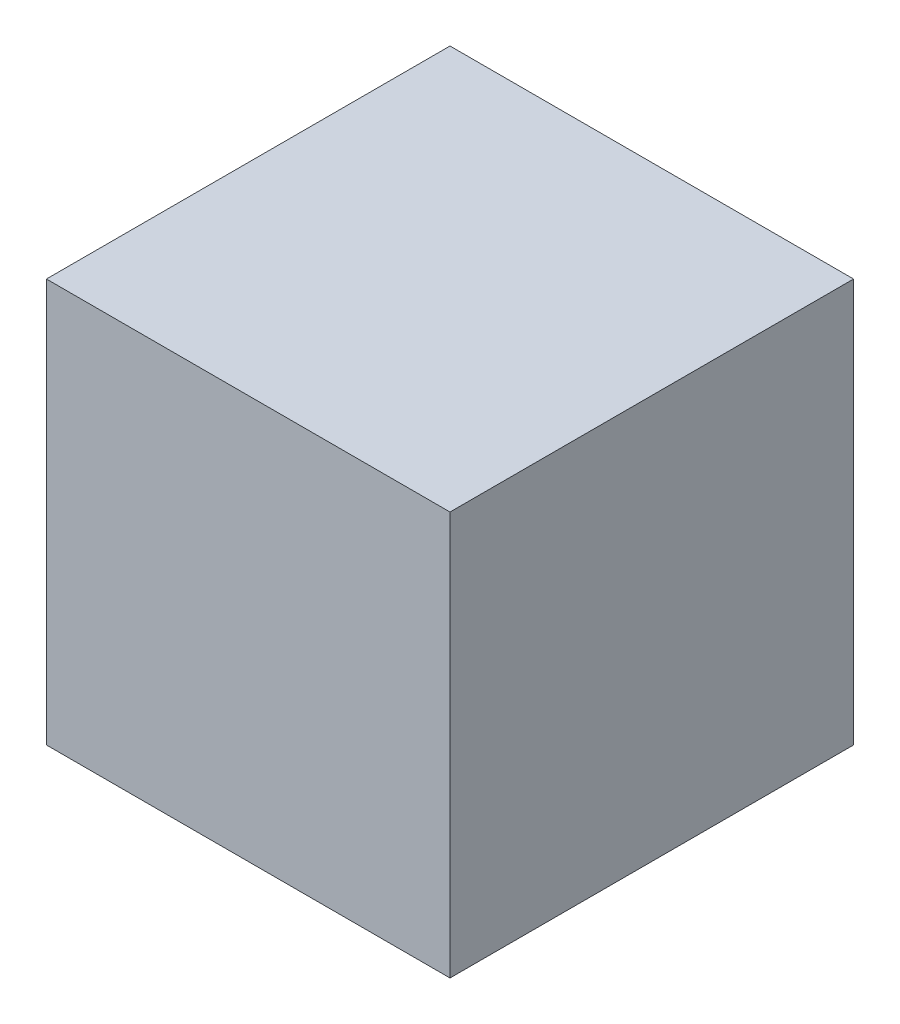
ISO-10303-21;
HEADER;
FILE_DESCRIPTION(('STEP AP214'),'2;1');
FILE_NAME('part.step','',(''),(''),'','','');
FILE_SCHEMA(('AUTOMOTIVE_DESIGN { 1 0 10303 214 1 1 1 1 }'));
ENDSEC;
DATA;
#1=APPLICATION_CONTEXT('core data for automotive mechanical design processes');
#2=APPLICATION_PROTOCOL_DEFINITION('international standard','automotive_design',2000,#1);
#3=PRODUCT_CONTEXT('',#1,'mechanical');
#4=PRODUCT('Part','Part','',(#3));
#5=PRODUCT_RELATED_PRODUCT_CATEGORY('part','',(#4));
#6=PRODUCT_DEFINITION_FORMATION('','',#4);
#7=PRODUCT_DEFINITION_CONTEXT('part definition',#1,'design');
#8=PRODUCT_DEFINITION('design','',#6,#7);
#9=PRODUCT_DEFINITION_SHAPE('','',#8);
#10=(LENGTH_UNIT() NAMED_UNIT(*) SI_UNIT(.MILLI.,.METRE.));
#11=(NAMED_UNIT(*) PLANE_ANGLE_UNIT() SI_UNIT($,.RADIAN.));
#12=(NAMED_UNIT(*) SI_UNIT($,.STERADIAN.) SOLID_ANGLE_UNIT());
#13=UNCERTAINTY_MEASURE_WITH_UNIT(LENGTH_MEASURE(1.E-05),#10,'distance_accuracy_value','');
#14=(GEOMETRIC_REPRESENTATION_CONTEXT(3) GLOBAL_UNCERTAINTY_ASSIGNED_CONTEXT((#13)) GLOBAL_UNIT_ASSIGNED_CONTEXT((#10,
#11,#12)) REPRESENTATION_CONTEXT('',''));
#15=CARTESIAN_POINT('',(0.,0.,0.));
#16=DIRECTION('',(0.,0.,1.));
#17=DIRECTION('',(1.,0.,0.));
#18=AXIS2_PLACEMENT_3D('',#15,#16,#17);
#19=CARTESIAN_POINT('',(24.,24.,48.));
#20=DIRECTION('',(-1.,0.,0.));
#21=DIRECTION('',(0.,-1.,0.));
#22=AXIS2_PLACEMENT_3D('',#19,#20,#21);
#23=PLANE('',#22);
#24=DIRECTION('',(0.,1.,0.));
#25=VECTOR('',#24,1.);
#26=CARTESIAN_POINT('',(24.,24.,0.));
#27=LINE('',#26,#25);
#28=CARTESIAN_POINT('',(24.,-24.,0.));
#29=VERTEX_POINT('',#28);
#30=CARTESIAN_POINT('',(24.,24.,0.));
#31=VERTEX_POINT('',#30);
#32=EDGE_CURVE('E99',#29,#31,#27,.T.);
#33=ORIENTED_EDGE('',*,*,#32,.T.);
#34=DIRECTION('',(0.,0.,-1.));
#35=VECTOR('',#34,1.);
#36=CARTESIAN_POINT('',(24.,24.,48.));
#37=LINE('',#36,#35);
#38=CARTESIAN_POINT('',(24.,24.,48.));
#39=VERTEX_POINT('',#38);
#40=EDGE_CURVE('E11',#39,#31,#37,.T.);
#41=ORIENTED_EDGE('',*,*,#40,.F.);
#42=DIRECTION('',(0.,1.,0.));
#43=VECTOR('',#42,1.);
#44=CARTESIAN_POINT('',(24.,24.,48.));
#45=LINE('',#44,#43);
#46=CARTESIAN_POINT('',(24.,-24.,48.));
#47=VERTEX_POINT('',#46);
#48=EDGE_CURVE('E87',#47,#39,#45,.T.);
#49=ORIENTED_EDGE('',*,*,#48,.F.);
#50=DIRECTION('',(0.,0.,-1.));
#51=VECTOR('',#50,1.);
#52=CARTESIAN_POINT('',(24.,-24.,48.));
#53=LINE('',#52,#51);
#54=EDGE_CURVE('E95',#47,#29,#53,.T.);
#55=ORIENTED_EDGE('',*,*,#54,.T.);
#56=EDGE_LOOP('',(#33,#41,#49,#55));
#57=FACE_BOUND('',#56,.T.);
#58=ADVANCED_FACE('F36',(#57),#23,.F.);
#59=CARTESIAN_POINT('',(-24.,24.,48.));
#60=DIRECTION('',(0.,-1.,0.));
#61=DIRECTION('',(0.,0.,-1.));
#62=AXIS2_PLACEMENT_3D('',#59,#60,#61);
#63=PLANE('',#62);
#64=DIRECTION('',(-1.,0.,0.));
#65=VECTOR('',#64,1.);
#66=CARTESIAN_POINT('',(-24.,24.,0.));
#67=LINE('',#66,#65);
#68=CARTESIAN_POINT('',(-24.,24.,0.));
#69=VERTEX_POINT('',#68);
#70=EDGE_CURVE('E91',#31,#69,#67,.T.);
#71=ORIENTED_EDGE('',*,*,#70,.T.);
#72=DIRECTION('',(0.,0.,-1.));
#73=VECTOR('',#72,1.);
#74=CARTESIAN_POINT('',(-24.,24.,48.));
#75=LINE('',#74,#73);
#76=CARTESIAN_POINT('',(-24.,24.,48.));
#77=VERTEX_POINT('',#76);
#78=EDGE_CURVE('E44',#77,#69,#75,.T.);
#79=ORIENTED_EDGE('',*,*,#78,.F.);
#80=DIRECTION('',(-1.,0.,0.));
#81=VECTOR('',#80,1.);
#82=CARTESIAN_POINT('',(-24.,24.,48.));
#83=LINE('',#82,#81);
#84=EDGE_CURVE('E82',#39,#77,#83,.T.);
#85=ORIENTED_EDGE('',*,*,#84,.F.);
#86=ORIENTED_EDGE('',*,*,#40,.T.);
#87=EDGE_LOOP('',(#71,#79,#85,#86));
#88=FACE_BOUND('',#87,.T.);
#89=ADVANCED_FACE('F90',(#88),#63,.F.);
#90=CARTESIAN_POINT('',(-24.,24.,48.));
#91=DIRECTION('',(1.,0.,0.));
#92=DIRECTION('',(0.,1.,0.));
#93=AXIS2_PLACEMENT_3D('',#90,#91,#92);
#94=PLANE('',#93);
#95=DIRECTION('',(0.,-1.,0.));
#96=VECTOR('',#95,1.);
#97=CARTESIAN_POINT('',(-24.,24.,0.));
#98=LINE('',#97,#96);
#99=CARTESIAN_POINT('',(-24.,-24.,0.));
#100=VERTEX_POINT('',#99);
#101=EDGE_CURVE('E69',#69,#100,#98,.T.);
#102=ORIENTED_EDGE('',*,*,#101,.T.);
#103=DIRECTION('',(0.,0.,-1.));
#104=VECTOR('',#103,1.);
#105=CARTESIAN_POINT('',(-24.,-24.,48.));
#106=LINE('',#105,#104);
#107=CARTESIAN_POINT('',(-24.,-24.,48.));
#108=VERTEX_POINT('',#107);
#109=EDGE_CURVE('E92',#108,#100,#106,.T.);
#110=ORIENTED_EDGE('',*,*,#109,.F.);
#111=DIRECTION('',(0.,-1.,0.));
#112=VECTOR('',#111,1.);
#113=CARTESIAN_POINT('',(-24.,24.,48.));
#114=LINE('',#113,#112);
#115=EDGE_CURVE('E85',#77,#108,#114,.T.);
#116=ORIENTED_EDGE('',*,*,#115,.F.);
#117=ORIENTED_EDGE('',*,*,#78,.T.);
#118=EDGE_LOOP('',(#102,#110,#116,#117));
#119=FACE_BOUND('',#118,.T.);
#120=ADVANCED_FACE('F93',(#119),#94,.F.);
#121=CARTESIAN_POINT('',(-24.,-24.,48.));
#122=DIRECTION('',(0.,1.,0.));
#123=DIRECTION('',(0.,0.,1.));
#124=AXIS2_PLACEMENT_3D('',#121,#122,#123);
#125=PLANE('',#124);
#126=DIRECTION('',(1.,0.,0.));
#127=VECTOR('',#126,1.);
#128=CARTESIAN_POINT('',(-24.,-24.,0.));
#129=LINE('',#128,#127);
#130=EDGE_CURVE('E75',#100,#29,#129,.T.);
#131=ORIENTED_EDGE('',*,*,#130,.T.);
#132=ORIENTED_EDGE('',*,*,#54,.F.);
#133=DIRECTION('',(1.,0.,0.));
#134=VECTOR('',#133,1.);
#135=CARTESIAN_POINT('',(-24.,-24.,48.));
#136=LINE('',#135,#134);
#137=EDGE_CURVE('E52',#108,#47,#136,.T.);
#138=ORIENTED_EDGE('',*,*,#137,.F.);
#139=ORIENTED_EDGE('',*,*,#109,.T.);
#140=EDGE_LOOP('',(#131,#132,#138,#139));
#141=FACE_BOUND('',#140,.T.);
#142=ADVANCED_FACE('F106',(#141),#125,.F.);
#143=CARTESIAN_POINT('',(0.,0.,48.));
#144=DIRECTION('',(0.,0.,1.));
#145=DIRECTION('',(1.,0.,0.));
#146=AXIS2_PLACEMENT_3D('',#143,#144,#145);
#147=PLANE('',#146);
#148=ORIENTED_EDGE('',*,*,#48,.T.);
#149=ORIENTED_EDGE('',*,*,#84,.T.);
#150=ORIENTED_EDGE('',*,*,#115,.T.);
#151=ORIENTED_EDGE('',*,*,#137,.T.);
#152=EDGE_LOOP('',(#148,#149,#150,#151));
#153=FACE_BOUND('',#152,.T.);
#154=ADVANCED_FACE('F83',(#153),#147,.T.);
#155=CARTESIAN_POINT('',(0.,0.,0.));
#156=DIRECTION('',(0.,0.,1.));
#157=DIRECTION('',(1.,0.,0.));
#158=AXIS2_PLACEMENT_3D('',#155,#156,#157);
#159=PLANE('',#158);
#160=ORIENTED_EDGE('',*,*,#32,.F.);
#161=ORIENTED_EDGE('',*,*,#130,.F.);
#162=ORIENTED_EDGE('',*,*,#101,.F.);
#163=ORIENTED_EDGE('',*,*,#70,.F.);
#164=EDGE_LOOP('',(#160,#161,#162,#163));
#165=FACE_BOUND('',#164,.T.);
#166=ADVANCED_FACE('F109',(#165),#159,.F.);
#167=CLOSED_SHELL('',(#58,#89,#120,#142,#154,#166));
#168=MANIFOLD_SOLID_BREP('B2',#167);
#169=ADVANCED_BREP_SHAPE_REPRESENTATION('',(#18,#168),#14);
#170=SHAPE_DEFINITION_REPRESENTATION(#9,#169);
ENDSEC;
END-ISO-10303-21;
